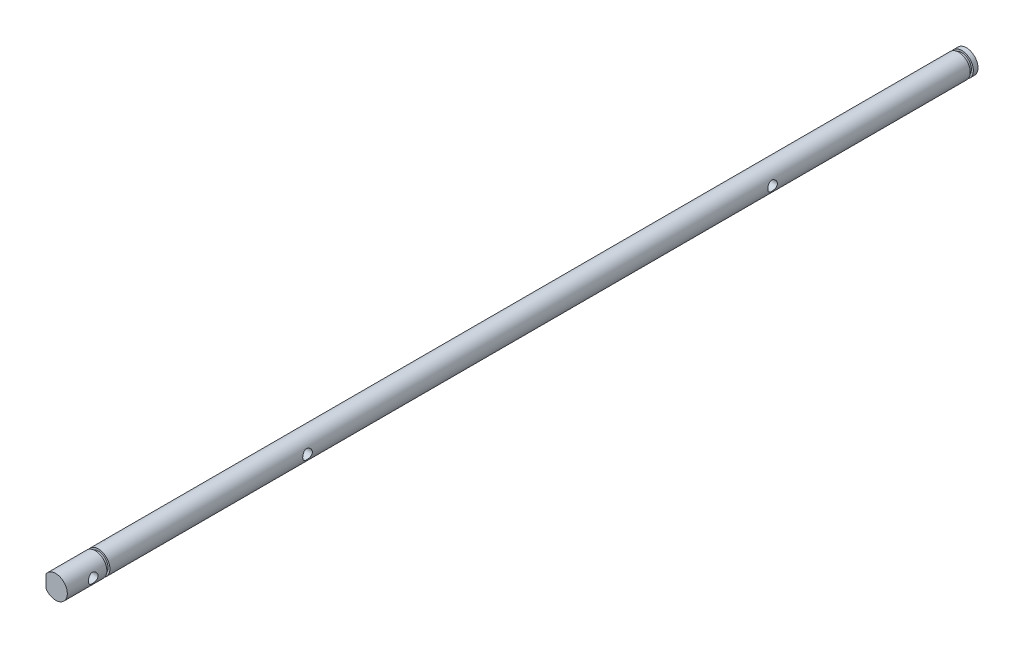
ISO-10303-21;
HEADER;
FILE_DESCRIPTION(('STEP AP214'),'2;1');
FILE_NAME('part.step','',(''),(''),'','','');
FILE_SCHEMA(('AUTOMOTIVE_DESIGN { 1 0 10303 214 1 1 1 1 }'));
ENDSEC;
DATA;
#1=APPLICATION_CONTEXT('core data for automotive mechanical design processes');
#2=APPLICATION_PROTOCOL_DEFINITION('international standard','automotive_design',2000,#1);
#3=PRODUCT_CONTEXT('',#1,'mechanical');
#4=PRODUCT('Part','Part','',(#3));
#5=PRODUCT_RELATED_PRODUCT_CATEGORY('part','',(#4));
#6=PRODUCT_DEFINITION_FORMATION('','',#4);
#7=PRODUCT_DEFINITION_CONTEXT('part definition',#1,'design');
#8=PRODUCT_DEFINITION('design','',#6,#7);
#9=PRODUCT_DEFINITION_SHAPE('','',#8);
#10=(LENGTH_UNIT() NAMED_UNIT(*) SI_UNIT(.MILLI.,.METRE.));
#11=(NAMED_UNIT(*) PLANE_ANGLE_UNIT() SI_UNIT($,.RADIAN.));
#12=(NAMED_UNIT(*) SI_UNIT($,.STERADIAN.) SOLID_ANGLE_UNIT());
#13=UNCERTAINTY_MEASURE_WITH_UNIT(LENGTH_MEASURE(1.E-05),#10,'distance_accuracy_value','');
#14=(GEOMETRIC_REPRESENTATION_CONTEXT(3) GLOBAL_UNCERTAINTY_ASSIGNED_CONTEXT((#13)) GLOBAL_UNIT_ASSIGNED_CONTEXT((#10,
#11,#12)) REPRESENTATION_CONTEXT('',''));
#15=CARTESIAN_POINT('',(0.,0.,0.));
#16=DIRECTION('',(0.,0.,1.));
#17=DIRECTION('',(1.,0.,0.));
#18=AXIS2_PLACEMENT_3D('',#15,#16,#17);
#19=CARTESIAN_POINT('',(0.,0.,235.));
#20=DIRECTION('',(0.,0.,-1.));
#21=DIRECTION('',(-1.,0.,0.));
#22=AXIS2_PLACEMENT_3D('',#19,#20,#21);
#23=CYLINDRICAL_SURFACE('',#22,3.);
#24=CARTESIAN_POINT('',(3.,0.,174.25));
#25=CARTESIAN_POINT('',(2.99999458367273,0.0669580526362664,174.249992794909));
#26=CARTESIAN_POINT('',(2.9977323297471,0.134021397063841,174.244588041472));
#27=CARTESIAN_POINT('',(2.98890153579552,0.266247371156346,174.22316093508));
#28=CARTESIAN_POINT('',(2.98232175901028,0.331404576423563,174.207110875536));
#29=CARTESIAN_POINT('',(2.96556289038127,0.457688733653088,174.165088908219));
#30=CARTESIAN_POINT('',(2.95539599975004,0.518828524426272,174.139150610532));
#31=CARTESIAN_POINT('',(2.93245286470664,0.635829756679803,174.078227176767));
#32=CARTESIAN_POINT('',(2.91967741092849,0.691692790015935,174.043244781029));
#33=CARTESIAN_POINT('',(2.89207828351869,0.799448403559509,173.963371017409));
#34=CARTESIAN_POINT('',(2.87718753326093,0.851041267517772,173.91809869121));
#35=CARTESIAN_POINT('',(2.84732714068513,0.946159821091267,173.819735665217));
#36=CARTESIAN_POINT('',(2.83235746106809,0.989681263153086,173.766640875105));
#37=CARTESIAN_POINT('',(2.80321021812995,1.06953737697065,173.650973222435));
#38=CARTESIAN_POINT('',(2.78910786873385,1.10541308153925,173.588062551573));
#39=CARTESIAN_POINT('',(2.76435572357005,1.16593940588866,173.456426742079));
#40=CARTESIAN_POINT('',(2.75370415000824,1.19059580836291,173.387704620516));
#41=CARTESIAN_POINT('',(2.73778555387705,1.22674598312159,173.249846308232));
#42=CARTESIAN_POINT('',(2.73228387651787,1.23881657877606,173.180889516608));
#43=CARTESIAN_POINT('',(2.72661326219504,1.25125209967796,173.041726707313));
#44=CARTESIAN_POINT('',(2.7264413842526,1.25162348054397,172.971521399974));
#45=CARTESIAN_POINT('',(2.73125119560853,1.24108450363674,172.837599939565));
#46=CARTESIAN_POINT('',(2.73583882723623,1.231036811123,172.773798903436));
#47=CARTESIAN_POINT('',(2.74898482773796,1.20139191015777,172.648887909));
#48=CARTESIAN_POINT('',(2.75754395703564,1.18179287287177,172.587778468508));
#49=CARTESIAN_POINT('',(2.77786184772757,1.13321958727571,172.468442297009));
#50=CARTESIAN_POINT('',(2.78968481949137,1.10405471539235,172.410304579087));
#51=CARTESIAN_POINT('',(2.81518331141086,1.03731242580561,172.29952226612));
#52=CARTESIAN_POINT('',(2.8288595612978,0.999731690519532,172.246879849386));
#53=CARTESIAN_POINT('',(2.8579297687798,0.913495965543826,172.143900041267));
#54=CARTESIAN_POINT('',(2.87337121404473,0.864173483207516,172.094133432615));
#55=CARTESIAN_POINT('',(2.9032567311253,0.757729591051503,172.003386497041));
#56=CARTESIAN_POINT('',(2.9177005687701,0.700606359448449,171.962408228308));
#57=CARTESIAN_POINT('',(2.94438283556473,0.578447948693366,171.889564176384));
#58=CARTESIAN_POINT('',(2.95656266543334,0.513260582447666,171.857930554849));
#59=CARTESIAN_POINT('',(2.97689481414803,0.377852402526821,171.806278860397));
#60=CARTESIAN_POINT('',(2.985049358458,0.307634394795034,171.786254368056));
#61=CARTESIAN_POINT('',(2.99599641186385,0.168928113346234,171.759584007873));
#62=CARTESIAN_POINT('',(2.99909541047125,0.100611285278643,171.752172142556));
#63=CARTESIAN_POINT('',(3.00056050368745,-0.0363546554960903,171.748653776386));
#64=CARTESIAN_POINT('',(2.99892795711939,-0.10500366715264,171.752544029748));
#65=CARTESIAN_POINT('',(2.9913121765694,-0.23709824234144,171.770971084806));
#66=CARTESIAN_POINT('',(2.9855488728399,-0.30063296663939,171.784969954097));
#67=CARTESIAN_POINT('',(2.97048606772414,-0.424382748971094,171.822468194541));
#68=CARTESIAN_POINT('',(2.96118611959704,-0.484597386518366,171.84596876595));
#69=CARTESIAN_POINT('',(2.93958270645166,-0.602108999869142,171.902570975712));
#70=CARTESIAN_POINT('',(2.92719491469281,-0.659257236855328,171.935948183146));
#71=CARTESIAN_POINT('',(2.9007380457909,-0.767346216231434,172.011053377792));
#72=CARTESIAN_POINT('',(2.88666826768733,-0.818284352601949,172.052784851529));
#73=CARTESIAN_POINT('',(2.85712087895437,-0.916333430274274,172.146903233272));
#74=CARTESIAN_POINT('',(2.84161451591029,-0.962910697979843,172.199838502986));
#75=CARTESIAN_POINT('',(2.81184336768005,-1.04666984610551,172.313021275935));
#76=CARTESIAN_POINT('',(2.79757886493438,-1.08384959285618,172.373270435172));
#77=CARTESIAN_POINT('',(2.77181386243988,-1.14815960208699,172.500614175303));
#78=CARTESIAN_POINT('',(2.76035562555112,-1.17513918237329,172.567794035515));
#79=CARTESIAN_POINT('',(2.74208355658957,-1.21717413951573,172.70637059381));
#80=CARTESIAN_POINT('',(2.73526589555752,-1.23223934863687,172.777763762483));
#81=CARTESIAN_POINT('',(2.72763164537264,-1.24904080348901,172.916818699199));
#82=CARTESIAN_POINT('',(2.72639350967163,-1.25171380413129,172.984344662293));
#83=CARTESIAN_POINT('',(2.72893853011024,-1.24615575523913,173.118842861141));
#84=CARTESIAN_POINT('',(2.73272091540306,-1.23792637964722,173.185815180314));
#85=CARTESIAN_POINT('',(2.74449551302268,-1.21158404780492,173.314092747469));
#86=CARTESIAN_POINT('',(2.7522835484648,-1.19394903571467,173.375516673463));
#87=CARTESIAN_POINT('',(2.77103181199189,-1.14976328202135,173.494548021357));
#88=CARTESIAN_POINT('',(2.78199293131693,-1.12321003517252,173.552154365399));
#89=CARTESIAN_POINT('',(2.80666954560013,-1.0601028593549,173.665695895949));
#90=CARTESIAN_POINT('',(2.82051102713679,-1.02304360910484,173.721322330168));
#91=CARTESIAN_POINT('',(2.84903689053839,-0.940684072630404,173.825860139361));
#92=CARTESIAN_POINT('',(2.86372156345874,-0.895380928905633,173.874769175601));
#93=CARTESIAN_POINT('',(2.89356392850106,-0.79390204577884,173.968148681685));
#94=CARTESIAN_POINT('',(2.90867817511791,-0.73717473994905,174.012036432841));
#95=CARTESIAN_POINT('',(2.9366014362202,-0.616600079253213,174.089699453544));
#96=CARTESIAN_POINT('',(2.9494093991674,-0.552749497945748,174.12347011489));
#97=CARTESIAN_POINT('',(2.97109183362461,-0.420732056717941,174.17920984544));
#98=CARTESIAN_POINT('',(2.98002782581964,-0.352653990980629,174.201364766617));
#99=CARTESIAN_POINT('',(2.99321009768625,-0.213410421846556,174.233706329078));
#100=CARTESIAN_POINT('',(2.99747105811967,-0.142255316980957,174.24393044253));
#101=CARTESIAN_POINT('',(2.99972287568934,-0.0472360819191842,174.249333161086));
#102=CARTESIAN_POINT('',(3.00000191102536,-0.0236245946756581,174.250002542149));
#103=CARTESIAN_POINT('',(3.,0.,174.25));
#104=B_SPLINE_CURVE_WITH_KNOTS('',3,(#24,#25,#26,#27,#28,#29,#30,#31,#32,#33,#34,#35,#36,#37,
#38,#39,#40,#41,#42,#43,#44,#45,#46,#47,#48,#49,#50,#51,#52,#53,#54,#55,#56,#57,#58,#59,#60,#61,
#62,#63,#64,#65,#66,#67,#68,#69,#70,#71,#72,#73,#74,#75,#76,#77,#78,#79,#80,#81,#82,#83,#84,#85,
#86,#87,#88,#89,#90,#91,#92,#93,#94,#95,#96,#97,#98,#99,#100,#101,#102,#103),.UNSPECIFIED.,.T.,
.F.,(4,2,2,2,2,2,2,2,2,2,2,2,2,2,2,2,2,2,2,2,2,2,2,2,2,2,2,2,2,2,2,2,2,2,2,2,2,2,2,4),(0.,
0.20080691888394,0.402138540628698,0.602791851906309,0.803384436852969,1.01317936288807,
1.22308438131465,1.44331724539126,1.66343646730588,1.87295273137561,2.08235338249048,
2.27570157202556,2.46908679727211,2.66658713058717,2.86416545717208,3.07844141127897,
3.29276749314589,3.51204055060815,3.73119224218296,3.93648443393251,4.14171767493172,
4.33676589735722,4.53183876601785,4.73297135272162,4.93418805469497,5.14978488029296,
5.36543061240343,5.58414788359521,5.80268447074579,6.00439877559641,6.20608211297534,
6.39837649964764,6.59072494950611,6.79463893397441,6.9986237342594,7.21746535004887,
7.43640649428583,7.65172855819385,7.86637250469321,7.93722256499098),.UNSPECIFIED.);
#105=CARTESIAN_POINT('',(3.,0.,174.25));
#106=VERTEX_POINT('',#105);
#107=EDGE_CURVE('E48',#106,#106,#104,.T.);
#108=ORIENTED_EDGE('',*,*,#107,.T.);
#109=EDGE_LOOP('',(#108));
#110=FACE_BOUND('',#109,.T.);
#111=CARTESIAN_POINT('',(3.,0.,54.25));
#112=CARTESIAN_POINT('',(2.99999458367273,0.0669580526362653,54.2499927949087));
#113=CARTESIAN_POINT('',(2.9977323297471,0.134021397063839,54.2445880414719));
#114=CARTESIAN_POINT('',(2.98890153579552,0.266247371156344,54.2231609350798));
#115=CARTESIAN_POINT('',(2.98232175901028,0.331404576423561,54.2071108755357));
#116=CARTESIAN_POINT('',(2.96556289038127,0.457688733653084,54.1650889082194));
#117=CARTESIAN_POINT('',(2.95539599975004,0.518828524426264,54.1391506105318));
#118=CARTESIAN_POINT('',(2.93245286470664,0.635829756679798,54.0782271767674));
#119=CARTESIAN_POINT('',(2.91967741092849,0.691692790015935,54.0432447810291));
#120=CARTESIAN_POINT('',(2.89207828351869,0.799448403559509,53.9633710174091));
#121=CARTESIAN_POINT('',(2.87718753326093,0.851041267517767,53.9180986912102));
#122=CARTESIAN_POINT('',(2.84732714068514,0.946159821091259,53.8197356652174));
#123=CARTESIAN_POINT('',(2.83235746106809,0.989681263153081,53.7666408751055));
#124=CARTESIAN_POINT('',(2.80321021812995,1.06953737697065,53.6509732224351));
#125=CARTESIAN_POINT('',(2.78910786873385,1.10541308153925,53.5880625515734));
#126=CARTESIAN_POINT('',(2.76435572357005,1.16593940588865,53.4564267420791));
#127=CARTESIAN_POINT('',(2.75370415000824,1.1905958083629,53.3877046205155));
#128=CARTESIAN_POINT('',(2.73778555387705,1.22674598312159,53.2498463082321));
#129=CARTESIAN_POINT('',(2.73228387651787,1.23881657877605,53.1808895166078));
#130=CARTESIAN_POINT('',(2.72661326219504,1.25125209967796,53.0417267073134));
#131=CARTESIAN_POINT('',(2.7264413842526,1.25162348054397,52.9715213999743));
#132=CARTESIAN_POINT('',(2.73125119560853,1.24108450363674,52.8375999395651));
#133=CARTESIAN_POINT('',(2.73583882723623,1.23103681112301,52.7737989034355));
#134=CARTESIAN_POINT('',(2.74898482773797,1.20139191015776,52.6488879089996));
#135=CARTESIAN_POINT('',(2.75754395703564,1.18179287287177,52.5877784685082));
#136=CARTESIAN_POINT('',(2.77786184772757,1.13321958727571,52.4684422970085));
#137=CARTESIAN_POINT('',(2.78968481949136,1.10405471539236,52.4103045790866));
#138=CARTESIAN_POINT('',(2.81518331141086,1.03731242580562,52.2995222661198));
#139=CARTESIAN_POINT('',(2.8288595612978,0.999731690519539,52.2468798493865));
#140=CARTESIAN_POINT('',(2.85792976877979,0.91349596554383,52.1439000412672));
#141=CARTESIAN_POINT('',(2.87337121404473,0.864173483207521,52.0941334326146));
#142=CARTESIAN_POINT('',(2.90325673112529,0.75772959105151,52.0033864970408));
#143=CARTESIAN_POINT('',(2.9177005687701,0.700606359448457,51.9624082283078));
#144=CARTESIAN_POINT('',(2.94438283556473,0.57844794869338,51.8895641763837));
#145=CARTESIAN_POINT('',(2.95656266543334,0.513260582447683,51.8579305548493));
#146=CARTESIAN_POINT('',(2.97689481414803,0.377852402526835,51.8062788603967));
#147=CARTESIAN_POINT('',(2.985049358458,0.307634394795039,51.7862543680562));
#148=CARTESIAN_POINT('',(2.99599641186385,0.168928113346232,51.7595840078734));
#149=CARTESIAN_POINT('',(2.99909541047125,0.100611285278643,51.7521721425562));
#150=CARTESIAN_POINT('',(3.00056050368745,-0.0363546554960863,51.7486537763859));
#151=CARTESIAN_POINT('',(2.99892795711939,-0.105003667152633,51.752544029748));
#152=CARTESIAN_POINT('',(2.9913121765694,-0.237098242341434,51.7709710848061));
#153=CARTESIAN_POINT('',(2.9855488728399,-0.300632966639385,51.7849699540972));
#154=CARTESIAN_POINT('',(2.97048606772414,-0.424382748971091,51.8224681945408));
#155=CARTESIAN_POINT('',(2.96118611959704,-0.484597386518363,51.8459687659503));
#156=CARTESIAN_POINT('',(2.93958270645166,-0.602108999869139,51.9025709757121));
#157=CARTESIAN_POINT('',(2.92719491469281,-0.659257236855326,51.935948183146));
#158=CARTESIAN_POINT('',(2.9007380457909,-0.767346216231432,52.0110533777917));
#159=CARTESIAN_POINT('',(2.88666826768733,-0.818284352601945,52.0527848515293));
#160=CARTESIAN_POINT('',(2.85712087895437,-0.916333430274267,52.1469032332724));
#161=CARTESIAN_POINT('',(2.84161451591029,-0.962910697979836,52.1998385029863));
#162=CARTESIAN_POINT('',(2.81184336768005,-1.04666984610551,52.3130212759354));
#163=CARTESIAN_POINT('',(2.79757886493438,-1.08384959285618,52.3732704351717));
#164=CARTESIAN_POINT('',(2.77181386243988,-1.14815960208699,52.5006141753026));
#165=CARTESIAN_POINT('',(2.76035562555111,-1.17513918237329,52.5677940355148));
#166=CARTESIAN_POINT('',(2.74208355658957,-1.21717413951573,52.7063705938101));
#167=CARTESIAN_POINT('',(2.73526589555752,-1.23223934863688,52.7777637624833));
#168=CARTESIAN_POINT('',(2.72763164537264,-1.24904080348901,52.9168186991992));
#169=CARTESIAN_POINT('',(2.72639350967163,-1.25171380413129,52.9843446622926));
#170=CARTESIAN_POINT('',(2.72893853011024,-1.24615575523912,53.1188428611411));
#171=CARTESIAN_POINT('',(2.73272091540306,-1.23792637964722,53.1858151803137));
#172=CARTESIAN_POINT('',(2.74449551302268,-1.21158404780491,53.3140927474689));
#173=CARTESIAN_POINT('',(2.7522835484648,-1.19394903571466,53.3755166734634));
#174=CARTESIAN_POINT('',(2.77103181199189,-1.14976328202135,53.4945480213572));
#175=CARTESIAN_POINT('',(2.78199293131693,-1.12321003517252,53.5521543653988));
#176=CARTESIAN_POINT('',(2.80666954560013,-1.0601028593549,53.6656958959491));
#177=CARTESIAN_POINT('',(2.82051102713679,-1.02304360910483,53.7213223301683));
#178=CARTESIAN_POINT('',(2.84903689053839,-0.940684072630391,53.8258601393607));
#179=CARTESIAN_POINT('',(2.86372156345875,-0.895380928905619,53.8747691756006));
#180=CARTESIAN_POINT('',(2.89356392850106,-0.79390204577882,53.9681486816847));
#181=CARTESIAN_POINT('',(2.90867817511792,-0.737174739949026,54.0120364328406));
#182=CARTESIAN_POINT('',(2.9366014362202,-0.616600079253198,54.0896994535436));
#183=CARTESIAN_POINT('',(2.9494093991674,-0.552749497945746,54.1234701148895));
#184=CARTESIAN_POINT('',(2.97109183362461,-0.420732056717952,54.1792098454399));
#185=CARTESIAN_POINT('',(2.98002782581964,-0.352653990980637,54.2013647666173));
#186=CARTESIAN_POINT('',(2.99321009768625,-0.213410421846559,54.2337063290778));
#187=CARTESIAN_POINT('',(2.99747105811967,-0.142255316980957,54.2439304425299));
#188=CARTESIAN_POINT('',(2.99972287568934,-0.0472360819191827,54.2493331610864));
#189=CARTESIAN_POINT('',(3.00000191102536,-0.0236245946756574,54.2500025421492));
#190=CARTESIAN_POINT('',(3.,0.,54.25));
#191=B_SPLINE_CURVE_WITH_KNOTS('',3,(#111,#112,#113,#114,#115,#116,#117,#118,#119,#120,#121,
#122,#123,#124,#125,#126,#127,#128,#129,#130,#131,#132,#133,#134,#135,#136,#137,#138,#139,#140,
#141,#142,#143,#144,#145,#146,#147,#148,#149,#150,#151,#152,#153,#154,#155,#156,#157,#158,#159,
#160,#161,#162,#163,#164,#165,#166,#167,#168,#169,#170,#171,#172,#173,#174,#175,#176,#177,#178,
#179,#180,#181,#182,#183,#184,#185,#186,#187,#188,#189,#190),.UNSPECIFIED.,.T.,.F.,(4,2,2,2,2,2,
2,2,2,2,2,2,2,2,2,2,2,2,2,2,2,2,2,2,2,2,2,2,2,2,2,2,2,2,2,2,2,2,2,4),(0.,0.200806918883938,
0.402138540628695,0.602791851906295,0.80338443685297,1.01317936288807,1.22308438131465,
1.44331724539125,1.66343646730588,1.87295273137557,2.08235338249046,2.27570157202557,
2.46908679727213,2.66658713058715,2.86416545717207,3.07844141127897,3.29276749314588,
3.51204055060813,3.73119224218296,3.9364844339325,4.14171767493171,4.33676589735721,
4.53183876601785,4.73297135272161,4.93418805469496,5.14978488029294,5.36543061240341,
5.58414788359523,5.80268447074581,6.00439877559644,6.20608211297536,6.39837649964762,
6.59072494950612,6.79463893397441,6.99862373425944,7.21746535004889,7.43640649428582,
7.65172855819385,7.86637250469321,7.93722256499098),.UNSPECIFIED.);
#192=CARTESIAN_POINT('',(3.,0.,54.25));
#193=VERTEX_POINT('',#192);
#194=EDGE_CURVE('E170',#193,#193,#191,.T.);
#195=ORIENTED_EDGE('',*,*,#194,.T.);
#196=EDGE_LOOP('',(#195));
#197=FACE_BOUND('',#196,.T.);
#198=DIRECTION('',(0.,0.,-1.));
#199=VECTOR('',#198,1.);
#200=CARTESIAN_POINT('',(-2.49999999999997,1.65831239517774,235.));
#201=LINE('',#200,#199);
#202=CARTESIAN_POINT('',(-2.49999999999998,1.65831239517774,178.));
#203=VERTEX_POINT('',#202);
#204=CARTESIAN_POINT('',(-2.49999999999999,1.65831239517772,168.));
#205=VERTEX_POINT('',#204);
#206=EDGE_CURVE('E158',#203,#205,#201,.T.);
#207=ORIENTED_EDGE('',*,*,#206,.F.);
#208=CARTESIAN_POINT('',(0.,0.,178.));
#209=DIRECTION('',(0.,0.,-1.));
#210=DIRECTION('',(-1.,0.,0.));
#211=AXIS2_PLACEMENT_3D('',#208,#209,#210);
#212=CIRCLE('',#211,3.);
#213=CARTESIAN_POINT('',(-2.49999999999998,-1.65831239517774,178.));
#214=VERTEX_POINT('',#213);
#215=EDGE_CURVE('E161',#214,#203,#212,.T.);
#216=ORIENTED_EDGE('',*,*,#215,.F.);
#217=DIRECTION('',(0.,0.,-1.));
#218=VECTOR('',#217,1.);
#219=CARTESIAN_POINT('',(-2.49999999999997,-1.65831239517774,235.));
#220=LINE('',#219,#218);
#221=CARTESIAN_POINT('',(-2.49999999999999,-1.65831239517772,168.));
#222=VERTEX_POINT('',#221);
#223=EDGE_CURVE('E156',#222,#214,#220,.F.);
#224=ORIENTED_EDGE('',*,*,#223,.F.);
#225=CARTESIAN_POINT('',(0.,0.,168.));
#226=DIRECTION('',(0.,0.,1.));
#227=DIRECTION('',(1.,0.,0.));
#228=AXIS2_PLACEMENT_3D('',#225,#226,#227);
#229=CIRCLE('',#228,3.);
#230=EDGE_CURVE('E111',#205,#222,#229,.T.);
#231=ORIENTED_EDGE('',*,*,#230,.F.);
#232=EDGE_LOOP('',(#207,#216,#224,#231));
#233=FACE_BOUND('',#232,.T.);
#234=CARTESIAN_POINT('',(0.,0.,224.));
#235=DIRECTION('',(0.,0.,1.));
#236=DIRECTION('',(1.,0.,0.));
#237=AXIS2_PLACEMENT_3D('',#234,#235,#236);
#238=CIRCLE('',#237,3.);
#239=CARTESIAN_POINT('',(3.,0.,224.));
#240=VERTEX_POINT('',#239);
#241=EDGE_CURVE('E139',#240,#240,#238,.T.);
#242=ORIENTED_EDGE('',*,*,#241,.F.);
#243=EDGE_LOOP('',(#242));
#244=FACE_BOUND('',#243,.T.);
#245=CARTESIAN_POINT('',(0.,0.,2.));
#246=DIRECTION('',(0.,0.,1.));
#247=DIRECTION('',(1.,0.,0.));
#248=AXIS2_PLACEMENT_3D('',#245,#246,#247);
#249=CIRCLE('',#248,3.);
#250=CARTESIAN_POINT('',(3.,0.,2.));
#251=VERTEX_POINT('',#250);
#252=EDGE_CURVE('E135',#251,#251,#249,.T.);
#253=ORIENTED_EDGE('',*,*,#252,.T.);
#254=EDGE_LOOP('',(#253));
#255=FACE_BOUND('',#254,.T.);
#256=DIRECTION('',(0.,0.,-1.));
#257=VECTOR('',#256,1.);
#258=CARTESIAN_POINT('',(-2.49999999999998,1.65831239517774,235.));
#259=LINE('',#258,#257);
#260=CARTESIAN_POINT('',(-2.5,1.65831239517774,58.));
#261=VERTEX_POINT('',#260);
#262=CARTESIAN_POINT('',(-2.5,1.6583123951777,48.));
#263=VERTEX_POINT('',#262);
#264=EDGE_CURVE('E166',#261,#263,#259,.T.);
#265=ORIENTED_EDGE('',*,*,#264,.F.);
#266=CARTESIAN_POINT('',(0.,0.,58.));
#267=DIRECTION('',(0.,0.,-1.));
#268=DIRECTION('',(-1.,0.,0.));
#269=AXIS2_PLACEMENT_3D('',#266,#267,#268);
#270=CIRCLE('',#269,3.);
#271=CARTESIAN_POINT('',(-2.5,-1.65831239517774,58.));
#272=VERTEX_POINT('',#271);
#273=EDGE_CURVE('E61',#272,#261,#270,.T.);
#274=ORIENTED_EDGE('',*,*,#273,.F.);
#275=DIRECTION('',(0.,0.,-1.));
#276=VECTOR('',#275,1.);
#277=CARTESIAN_POINT('',(-2.49999999999998,-1.65831239517774,235.));
#278=LINE('',#277,#276);
#279=CARTESIAN_POINT('',(-2.5,-1.6583123951777,48.));
#280=VERTEX_POINT('',#279);
#281=EDGE_CURVE('E55',#280,#272,#278,.F.);
#282=ORIENTED_EDGE('',*,*,#281,.F.);
#283=CARTESIAN_POINT('',(0.,0.,48.));
#284=DIRECTION('',(0.,0.,1.));
#285=DIRECTION('',(1.,0.,0.));
#286=AXIS2_PLACEMENT_3D('',#283,#284,#285);
#287=CIRCLE('',#286,3.);
#288=EDGE_CURVE('E163',#263,#280,#287,.T.);
#289=ORIENTED_EDGE('',*,*,#288,.F.);
#290=EDGE_LOOP('',(#265,#274,#282,#289));
#291=FACE_BOUND('',#290,.T.);
#292=ADVANCED_FACE('F36',(#110,#197,#233,#244,#255,#291),#23,.T.);
#293=CARTESIAN_POINT('',(0.,0.,235.));
#294=DIRECTION('',(0.,0.,1.));
#295=DIRECTION('',(1.,0.,0.));
#296=AXIS2_PLACEMENT_3D('',#293,#294,#295);
#297=PLANE('',#296);
#298=CARTESIAN_POINT('',(0.,0.,235.));
#299=DIRECTION('',(0.,0.,1.));
#300=DIRECTION('',(1.,0.,0.));
#301=AXIS2_PLACEMENT_3D('',#298,#299,#300);
#302=CIRCLE('',#301,3.);
#303=CARTESIAN_POINT('',(-2.49999999999998,-1.65831239517773,235.));
#304=VERTEX_POINT('',#303);
#305=CARTESIAN_POINT('',(-2.49999999999998,1.65831239517773,235.));
#306=VERTEX_POINT('',#305);
#307=EDGE_CURVE('E104',#304,#306,#302,.T.);
#308=ORIENTED_EDGE('',*,*,#307,.T.);
#309=DIRECTION('',(0.,-1.,0.));
#310=VECTOR('',#309,1.);
#311=CARTESIAN_POINT('',(-2.49999999999998,10.,235.));
#312=LINE('',#311,#310);
#313=EDGE_CURVE('E110',#306,#304,#312,.T.);
#314=ORIENTED_EDGE('',*,*,#313,.T.);
#315=EDGE_LOOP('',(#308,#314));
#316=FACE_BOUND('',#315,.T.);
#317=ADVANCED_FACE('F240',(#316),#297,.T.);
#318=CARTESIAN_POINT('',(3.,0.,229.55));
#319=CARTESIAN_POINT('',(2.99999458367273,0.0669580526362677,229.549992794909));
#320=CARTESIAN_POINT('',(2.9977323297471,0.134021397063842,229.544588041472));
#321=CARTESIAN_POINT('',(2.98890153579552,0.266247371156348,229.52316093508));
#322=CARTESIAN_POINT('',(2.98232175901028,0.331404576423564,229.507110875536));
#323=CARTESIAN_POINT('',(2.96556289038127,0.457688733653094,229.465088908219));
#324=CARTESIAN_POINT('',(2.95539599975003,0.518828524426282,229.439150610532));
#325=CARTESIAN_POINT('',(2.93245286470664,0.635829756679813,229.378227176767));
#326=CARTESIAN_POINT('',(2.91967741092849,0.69169279001594,229.343244781029));
#327=CARTESIAN_POINT('',(2.89207828351869,0.79944840355951,229.263371017409));
#328=CARTESIAN_POINT('',(2.87718753326093,0.851041267517774,229.21809869121));
#329=CARTESIAN_POINT('',(2.84732714068513,0.946159821091269,229.119735665217));
#330=CARTESIAN_POINT('',(2.83235746106809,0.989681263153088,229.066640875105));
#331=CARTESIAN_POINT('',(2.80321021812995,1.06953737697066,228.950973222435));
#332=CARTESIAN_POINT('',(2.78910786873385,1.10541308153925,228.888062551573));
#333=CARTESIAN_POINT('',(2.76435572357005,1.16593940588866,228.756426742079));
#334=CARTESIAN_POINT('',(2.75370415000824,1.19059580836291,228.687704620516));
#335=CARTESIAN_POINT('',(2.73778555387705,1.22674598312159,228.549846308232));
#336=CARTESIAN_POINT('',(2.73228387651787,1.23881657877605,228.480889516608));
#337=CARTESIAN_POINT('',(2.72661326219504,1.25125209967796,228.341726707313));
#338=CARTESIAN_POINT('',(2.7264413842526,1.25162348054397,228.271521399974));
#339=CARTESIAN_POINT('',(2.73125119560853,1.24108450363674,228.137599939565));
#340=CARTESIAN_POINT('',(2.73583882723623,1.23103681112301,228.073798903436));
#341=CARTESIAN_POINT('',(2.74898482773796,1.20139191015777,227.948887909));
#342=CARTESIAN_POINT('',(2.75754395703564,1.18179287287177,227.887778468508));
#343=CARTESIAN_POINT('',(2.77786184772757,1.13321958727571,227.768442297009));
#344=CARTESIAN_POINT('',(2.78968481949137,1.10405471539235,227.710304579087));
#345=CARTESIAN_POINT('',(2.81518331141086,1.03731242580561,227.59952226612));
#346=CARTESIAN_POINT('',(2.8288595612978,0.999731690519532,227.546879849386));
#347=CARTESIAN_POINT('',(2.8579297687798,0.913495965543826,227.443900041267));
#348=CARTESIAN_POINT('',(2.87337121404473,0.864173483207516,227.394133432615));
#349=CARTESIAN_POINT('',(2.9032567311253,0.757729591051503,227.303386497041));
#350=CARTESIAN_POINT('',(2.9177005687701,0.700606359448448,227.262408228308));
#351=CARTESIAN_POINT('',(2.94438283556473,0.578447948693371,227.189564176384));
#352=CARTESIAN_POINT('',(2.95656266543334,0.513260582447677,227.157930554849));
#353=CARTESIAN_POINT('',(2.97689481414803,0.377852402526834,227.106278860397));
#354=CARTESIAN_POINT('',(2.985049358458,0.30763439479504,227.086254368056));
#355=CARTESIAN_POINT('',(2.99599641186385,0.168928113346234,227.059584007873));
#356=CARTESIAN_POINT('',(2.99909541047125,0.100611285278643,227.052172142556));
#357=CARTESIAN_POINT('',(3.00056050368745,-0.0363546554960897,227.048653776386));
#358=CARTESIAN_POINT('',(2.99892795711939,-0.105003667152639,227.052544029748));
#359=CARTESIAN_POINT('',(2.9913121765694,-0.23709824234144,227.070971084806));
#360=CARTESIAN_POINT('',(2.9855488728399,-0.30063296663939,227.084969954097));
#361=CARTESIAN_POINT('',(2.97048606772414,-0.424382748971095,227.122468194541));
#362=CARTESIAN_POINT('',(2.96118611959704,-0.484597386518367,227.14596876595));
#363=CARTESIAN_POINT('',(2.93958270645166,-0.602108999869142,227.202570975712));
#364=CARTESIAN_POINT('',(2.92719491469281,-0.659257236855327,227.235948183146));
#365=CARTESIAN_POINT('',(2.9007380457909,-0.767346216231432,227.311053377792));
#366=CARTESIAN_POINT('',(2.88666826768733,-0.818284352601947,227.352784851529));
#367=CARTESIAN_POINT('',(2.85712087895437,-0.916333430274271,227.446903233272));
#368=CARTESIAN_POINT('',(2.84161451591029,-0.962910697979841,227.499838502986));
#369=CARTESIAN_POINT('',(2.81184336768005,-1.04666984610551,227.613021275935));
#370=CARTESIAN_POINT('',(2.79757886493438,-1.08384959285618,227.673270435172));
#371=CARTESIAN_POINT('',(2.77181386243988,-1.148159602087,227.800614175303));
#372=CARTESIAN_POINT('',(2.76035562555111,-1.17513918237329,227.867794035515));
#373=CARTESIAN_POINT('',(2.74208355658957,-1.21717413951573,228.00637059381));
#374=CARTESIAN_POINT('',(2.73526589555752,-1.23223934863687,228.077763762483));
#375=CARTESIAN_POINT('',(2.72763164537264,-1.249040803489,228.216818699199));
#376=CARTESIAN_POINT('',(2.72639350967163,-1.25171380413129,228.284344662293));
#377=CARTESIAN_POINT('',(2.72893853011024,-1.24615575523912,228.418842861141));
#378=CARTESIAN_POINT('',(2.73272091540306,-1.23792637964721,228.485815180314));
#379=CARTESIAN_POINT('',(2.74449551302268,-1.21158404780491,228.614092747469));
#380=CARTESIAN_POINT('',(2.7522835484648,-1.19394903571467,228.675516673463));
#381=CARTESIAN_POINT('',(2.77103181199189,-1.14976328202135,228.794548021357));
#382=CARTESIAN_POINT('',(2.78199293131693,-1.12321003517252,228.852154365399));
#383=CARTESIAN_POINT('',(2.80666954560013,-1.0601028593549,228.965695895949));
#384=CARTESIAN_POINT('',(2.82051102713679,-1.02304360910484,229.021322330168));
#385=CARTESIAN_POINT('',(2.84903689053839,-0.940684072630403,229.125860139361));
#386=CARTESIAN_POINT('',(2.86372156345874,-0.895380928905633,229.174769175601));
#387=CARTESIAN_POINT('',(2.89356392850106,-0.79390204577884,229.268148681685));
#388=CARTESIAN_POINT('',(2.90867817511791,-0.73717473994905,229.312036432841));
#389=CARTESIAN_POINT('',(2.9366014362202,-0.616600079253213,229.389699453544));
#390=CARTESIAN_POINT('',(2.9494093991674,-0.552749497945748,229.42347011489));
#391=CARTESIAN_POINT('',(2.97109183362461,-0.420732056717943,229.47920984544));
#392=CARTESIAN_POINT('',(2.98002782581964,-0.35265399098063,229.501364766617));
#393=CARTESIAN_POINT('',(2.99321009768625,-0.213410421846558,229.533706329078));
#394=CARTESIAN_POINT('',(2.99747105811967,-0.142255316980959,229.54393044253));
#395=CARTESIAN_POINT('',(2.99972287568934,-0.0472360819191854,229.549333161086));
#396=CARTESIAN_POINT('',(3.00000191102536,-0.0236245946756581,229.550002542149));
#397=CARTESIAN_POINT('',(3.,0.,229.55));
#398=B_SPLINE_CURVE_WITH_KNOTS('',3,(#318,#319,#320,#321,#322,#323,#324,#325,#326,#327,#328,
#329,#330,#331,#332,#333,#334,#335,#336,#337,#338,#339,#340,#341,#342,#343,#344,#345,#346,#347,
#348,#349,#350,#351,#352,#353,#354,#355,#356,#357,#358,#359,#360,#361,#362,#363,#364,#365,#366,
#367,#368,#369,#370,#371,#372,#373,#374,#375,#376,#377,#378,#379,#380,#381,#382,#383,#384,#385,
#386,#387,#388,#389,#390,#391,#392,#393,#394,#395,#396,#397),.UNSPECIFIED.,.T.,.F.,(4,2,2,2,2,2,
2,2,2,2,2,2,2,2,2,2,2,2,2,2,2,2,2,2,2,2,2,2,2,2,2,2,2,2,2,2,2,2,2,4),(0.,0.20080691888394,
0.402138540628698,0.60279185190632,0.80338443685297,1.01317936288807,1.22308438131465,
1.44331724539126,1.66343646730588,1.87295273137558,2.08235338249048,2.27570157202556,
2.46908679727212,2.66658713058717,2.86416545717208,3.07844141127897,3.29276749314589,
3.51204055060813,3.73119224218296,3.93648443393251,4.14171767493173,4.33676589735722,
4.53183876601785,4.73297135272162,4.93418805469497,5.14978488029296,5.36543061240343,
5.58414788359524,5.80268447074579,6.00439877559641,6.20608211297535,6.39837649964764,
6.59072494950612,6.79463893397441,6.9986237342594,7.21746535004887,7.43640649428583,
7.65172855819385,7.86637250469321,7.93722256499098),.UNSPECIFIED.);
#399=CARTESIAN_POINT('',(3.,0.,229.55));
#400=VERTEX_POINT('',#399);
#401=EDGE_CURVE('E11',#400,#400,#398,.T.);
#402=ORIENTED_EDGE('',*,*,#401,.T.);
#403=EDGE_LOOP('',(#402));
#404=FACE_BOUND('',#403,.T.);
#405=CARTESIAN_POINT('',(0.,0.,224.8));
#406=DIRECTION('',(0.,0.,1.));
#407=DIRECTION('',(1.,0.,0.));
#408=AXIS2_PLACEMENT_3D('',#405,#406,#407);
#409=CIRCLE('',#408,3.);
#410=CARTESIAN_POINT('',(3.,0.,224.8));
#411=VERTEX_POINT('',#410);
#412=EDGE_CURVE('E129',#411,#411,#409,.T.);
#413=ORIENTED_EDGE('',*,*,#412,.T.);
#414=EDGE_LOOP('',(#413));
#415=FACE_BOUND('',#414,.T.);
#416=DIRECTION('',(0.,0.,-1.));
#417=VECTOR('',#416,1.);
#418=CARTESIAN_POINT('',(-2.49999999999998,1.65831239517773,235.));
#419=LINE('',#418,#417);
#420=CARTESIAN_POINT('',(-2.49999999999998,1.65831239517773,226.));
#421=VERTEX_POINT('',#420);
#422=EDGE_CURVE('E98',#306,#421,#419,.T.);
#423=ORIENTED_EDGE('',*,*,#422,.F.);
#424=ORIENTED_EDGE('',*,*,#307,.F.);
#425=DIRECTION('',(0.,0.,-1.));
#426=VECTOR('',#425,1.);
#427=CARTESIAN_POINT('',(-2.49999999999998,-1.65831239517773,235.));
#428=LINE('',#427,#426);
#429=CARTESIAN_POINT('',(-2.49999999999998,-1.65831239517773,226.));
#430=VERTEX_POINT('',#429);
#431=EDGE_CURVE('E100',#430,#304,#428,.F.);
#432=ORIENTED_EDGE('',*,*,#431,.F.);
#433=CARTESIAN_POINT('',(0.,0.,226.));
#434=DIRECTION('',(0.,0.,1.));
#435=DIRECTION('',(1.,0.,0.));
#436=AXIS2_PLACEMENT_3D('',#433,#434,#435);
#437=CIRCLE('',#436,3.);
#438=EDGE_CURVE('E94',#421,#430,#437,.T.);
#439=ORIENTED_EDGE('',*,*,#438,.F.);
#440=EDGE_LOOP('',(#423,#424,#432,#439));
#441=FACE_BOUND('',#440,.T.);
#442=ADVANCED_FACE('F96',(#404,#415,#441),#23,.T.);
#443=CARTESIAN_POINT('',(0.,0.,0.));
#444=DIRECTION('',(0.,0.,1.));
#445=DIRECTION('',(1.,0.,0.));
#446=AXIS2_PLACEMENT_3D('',#443,#444,#445);
#447=CIRCLE('',#446,3.);
#448=CARTESIAN_POINT('',(3.,0.,0.));
#449=VERTEX_POINT('',#448);
#450=EDGE_CURVE('E138',#449,#449,#447,.T.);
#451=ORIENTED_EDGE('',*,*,#450,.T.);
#452=EDGE_LOOP('',(#451));
#453=FACE_BOUND('',#452,.T.);
#454=CARTESIAN_POINT('',(0.,0.,1.20000000000001));
#455=DIRECTION('',(0.,0.,1.));
#456=DIRECTION('',(1.,0.,0.));
#457=AXIS2_PLACEMENT_3D('',#454,#455,#456);
#458=CIRCLE('',#457,3.);
#459=CARTESIAN_POINT('',(3.,0.,1.20000000000001));
#460=VERTEX_POINT('',#459);
#461=EDGE_CURVE('E125',#460,#460,#458,.T.);
#462=ORIENTED_EDGE('',*,*,#461,.F.);
#463=EDGE_LOOP('',(#462));
#464=FACE_BOUND('',#463,.T.);
#465=ADVANCED_FACE('F244',(#453,#464),#23,.T.);
#466=CARTESIAN_POINT('',(0.,0.,0.));
#467=DIRECTION('',(0.,0.,1.));
#468=DIRECTION('',(1.,0.,0.));
#469=AXIS2_PLACEMENT_3D('',#466,#467,#468);
#470=PLANE('',#469);
#471=ORIENTED_EDGE('',*,*,#450,.F.);
#472=EDGE_LOOP('',(#471));
#473=FACE_BOUND('',#472,.T.);
#474=ADVANCED_FACE('F228',(#473),#470,.F.);
#475=CARTESIAN_POINT('',(-3.,0.,2.));
#476=DIRECTION('',(0.,0.,-1.));
#477=DIRECTION('',(-1.,0.,0.));
#478=AXIS2_PLACEMENT_3D('',#475,#476,#477);
#479=PLANE('',#478);
#480=CARTESIAN_POINT('',(0.,0.,2.));
#481=DIRECTION('',(0.,0.,1.));
#482=DIRECTION('',(1.,0.,0.));
#483=AXIS2_PLACEMENT_3D('',#480,#481,#482);
#484=CIRCLE('',#483,2.5);
#485=CARTESIAN_POINT('',(2.5,0.,2.));
#486=VERTEX_POINT('',#485);
#487=EDGE_CURVE('E132',#486,#486,#484,.T.);
#488=ORIENTED_EDGE('',*,*,#487,.T.);
#489=EDGE_LOOP('',(#488));
#490=FACE_BOUND('',#489,.T.);
#491=ORIENTED_EDGE('',*,*,#252,.F.);
#492=EDGE_LOOP('',(#491));
#493=FACE_BOUND('',#492,.T.);
#494=ADVANCED_FACE('F224',(#490,#493),#479,.T.);
#495=CARTESIAN_POINT('',(0.,0.,240.));
#496=DIRECTION('',(0.,0.,1.));
#497=DIRECTION('',(1.,0.,0.));
#498=AXIS2_PLACEMENT_3D('',#495,#496,#497);
#499=CYLINDRICAL_SURFACE('',#498,2.5);
#500=CARTESIAN_POINT('',(0.,0.,1.20000000000001));
#501=DIRECTION('',(0.,0.,1.));
#502=DIRECTION('',(1.,0.,0.));
#503=AXIS2_PLACEMENT_3D('',#500,#501,#502);
#504=CIRCLE('',#503,2.5);
#505=CARTESIAN_POINT('',(2.5,0.,1.20000000000001));
#506=VERTEX_POINT('',#505);
#507=EDGE_CURVE('E128',#506,#506,#504,.T.);
#508=ORIENTED_EDGE('',*,*,#507,.T.);
#509=EDGE_LOOP('',(#508));
#510=FACE_BOUND('',#509,.T.);
#511=ORIENTED_EDGE('',*,*,#487,.F.);
#512=EDGE_LOOP('',(#511));
#513=FACE_BOUND('',#512,.T.);
#514=ADVANCED_FACE('F220',(#510,#513),#499,.T.);
#515=CARTESIAN_POINT('',(-3.,0.,1.2));
#516=DIRECTION('',(0.,0.,1.));
#517=DIRECTION('',(1.,0.,0.));
#518=AXIS2_PLACEMENT_3D('',#515,#516,#517);
#519=PLANE('',#518);
#520=ORIENTED_EDGE('',*,*,#461,.T.);
#521=EDGE_LOOP('',(#520));
#522=FACE_BOUND('',#521,.T.);
#523=ORIENTED_EDGE('',*,*,#507,.F.);
#524=EDGE_LOOP('',(#523));
#525=FACE_BOUND('',#524,.T.);
#526=ADVANCED_FACE('F216',(#522,#525),#519,.T.);
#527=CARTESIAN_POINT('',(-3.,0.,224.8));
#528=DIRECTION('',(0.,0.,-1.));
#529=DIRECTION('',(-1.,0.,0.));
#530=AXIS2_PLACEMENT_3D('',#527,#528,#529);
#531=PLANE('',#530);
#532=CARTESIAN_POINT('',(0.,0.,224.8));
#533=DIRECTION('',(0.,0.,1.));
#534=DIRECTION('',(1.,0.,0.));
#535=AXIS2_PLACEMENT_3D('',#532,#533,#534);
#536=CIRCLE('',#535,2.49999999999997);
#537=CARTESIAN_POINT('',(2.49999999999997,0.,224.8));
#538=VERTEX_POINT('',#537);
#539=EDGE_CURVE('E146',#538,#538,#536,.T.);
#540=ORIENTED_EDGE('',*,*,#539,.T.);
#541=EDGE_LOOP('',(#540));
#542=FACE_BOUND('',#541,.T.);
#543=ORIENTED_EDGE('',*,*,#412,.F.);
#544=EDGE_LOOP('',(#543));
#545=FACE_BOUND('',#544,.T.);
#546=ADVANCED_FACE('F219',(#542,#545),#531,.T.);
#547=CARTESIAN_POINT('',(0.,0.,240.));
#548=DIRECTION('',(0.,0.,1.));
#549=DIRECTION('',(1.,0.,0.));
#550=AXIS2_PLACEMENT_3D('',#547,#548,#549);
#551=CYLINDRICAL_SURFACE('',#550,2.49999999999997);
#552=CARTESIAN_POINT('',(0.,0.,224.));
#553=DIRECTION('',(0.,0.,1.));
#554=DIRECTION('',(1.,0.,0.));
#555=AXIS2_PLACEMENT_3D('',#552,#553,#554);
#556=CIRCLE('',#555,2.49999999999997);
#557=CARTESIAN_POINT('',(2.49999999999997,0.,224.));
#558=VERTEX_POINT('',#557);
#559=EDGE_CURVE('E142',#558,#558,#556,.T.);
#560=ORIENTED_EDGE('',*,*,#559,.T.);
#561=EDGE_LOOP('',(#560));
#562=FACE_BOUND('',#561,.T.);
#563=ORIENTED_EDGE('',*,*,#539,.F.);
#564=EDGE_LOOP('',(#563));
#565=FACE_BOUND('',#564,.T.);
#566=ADVANCED_FACE('F232',(#562,#565),#551,.T.);
#567=CARTESIAN_POINT('',(-3.,0.,224.));
#568=DIRECTION('',(0.,0.,1.));
#569=DIRECTION('',(1.,0.,0.));
#570=AXIS2_PLACEMENT_3D('',#567,#568,#569);
#571=PLANE('',#570);
#572=ORIENTED_EDGE('',*,*,#241,.T.);
#573=EDGE_LOOP('',(#572));
#574=FACE_BOUND('',#573,.T.);
#575=ORIENTED_EDGE('',*,*,#559,.F.);
#576=EDGE_LOOP('',(#575));
#577=FACE_BOUND('',#576,.T.);
#578=ADVANCED_FACE('F214',(#574,#577),#571,.T.);
#579=CARTESIAN_POINT('',(-2.49999999999998,10.,235.));
#580=DIRECTION('',(-1.,0.,0.));
#581=DIRECTION('',(0.,0.,1.));
#582=AXIS2_PLACEMENT_3D('',#579,#580,#581);
#583=PLANE('',#582);
#584=CARTESIAN_POINT('',(-2.49999999999998,0.,228.3));
#585=DIRECTION('',(-1.,0.,0.));
#586=DIRECTION('',(0.,0.,1.));
#587=AXIS2_PLACEMENT_3D('',#584,#585,#586);
#588=CIRCLE('',#587,1.25);
#589=CARTESIAN_POINT('',(-2.49999999999998,0.,229.55));
#590=VERTEX_POINT('',#589);
#591=EDGE_CURVE('E276',#590,#590,#588,.T.);
#592=ORIENTED_EDGE('',*,*,#591,.F.);
#593=EDGE_LOOP('',(#592));
#594=FACE_BOUND('',#593,.T.);
#595=ORIENTED_EDGE('',*,*,#422,.T.);
#596=DIRECTION('',(0.,-1.,0.));
#597=VECTOR('',#596,1.);
#598=CARTESIAN_POINT('',(-2.49999999999998,10.,226.));
#599=LINE('',#598,#597);
#600=EDGE_CURVE('E108',#421,#430,#599,.T.);
#601=ORIENTED_EDGE('',*,*,#600,.T.);
#602=ORIENTED_EDGE('',*,*,#431,.T.);
#603=ORIENTED_EDGE('',*,*,#313,.F.);
#604=EDGE_LOOP('',(#595,#601,#602,#603));
#605=FACE_BOUND('',#604,.T.);
#606=ADVANCED_FACE('F107',(#594,#605),#583,.T.);
#607=CARTESIAN_POINT('',(-3.,10.,226.));
#608=DIRECTION('',(0.,0.,1.));
#609=DIRECTION('',(1.,0.,0.));
#610=AXIS2_PLACEMENT_3D('',#607,#608,#609);
#611=PLANE('',#610);
#612=ORIENTED_EDGE('',*,*,#600,.F.);
#613=ORIENTED_EDGE('',*,*,#438,.T.);
#614=EDGE_LOOP('',(#612,#613));
#615=FACE_BOUND('',#614,.T.);
#616=ADVANCED_FACE('F113',(#615),#611,.T.);
#617=CARTESIAN_POINT('',(-3.,10.,178.));
#618=DIRECTION('',(0.,0.,-1.));
#619=DIRECTION('',(-1.,0.,0.));
#620=AXIS2_PLACEMENT_3D('',#617,#618,#619);
#621=PLANE('',#620);
#622=ORIENTED_EDGE('',*,*,#215,.T.);
#623=DIRECTION('',(0.,-1.,0.));
#624=VECTOR('',#623,1.);
#625=CARTESIAN_POINT('',(-2.49999999999998,10.,178.));
#626=LINE('',#625,#624);
#627=EDGE_CURVE('E122',#203,#214,#626,.T.);
#628=ORIENTED_EDGE('',*,*,#627,.T.);
#629=EDGE_LOOP('',(#622,#628));
#630=FACE_BOUND('',#629,.T.);
#631=ADVANCED_FACE('F205',(#630),#621,.T.);
#632=CARTESIAN_POINT('',(-2.49999999999999,10.,168.));
#633=DIRECTION('',(-1.,0.,0.));
#634=DIRECTION('',(0.,0.,1.));
#635=AXIS2_PLACEMENT_3D('',#632,#633,#634);
#636=PLANE('',#635);
#637=CARTESIAN_POINT('',(-2.49999999999998,0.,173.));
#638=DIRECTION('',(-1.,0.,0.));
#639=DIRECTION('',(0.,0.,1.));
#640=AXIS2_PLACEMENT_3D('',#637,#638,#639);
#641=CIRCLE('',#640,1.25);
#642=CARTESIAN_POINT('',(-2.49999999999998,0.,174.25));
#643=VERTEX_POINT('',#642);
#644=EDGE_CURVE('E119',#643,#643,#641,.T.);
#645=ORIENTED_EDGE('',*,*,#644,.F.);
#646=EDGE_LOOP('',(#645));
#647=FACE_BOUND('',#646,.T.);
#648=ORIENTED_EDGE('',*,*,#206,.T.);
#649=DIRECTION('',(0.,-1.,0.));
#650=VECTOR('',#649,1.);
#651=CARTESIAN_POINT('',(-2.49999999999999,10.,168.));
#652=LINE('',#651,#650);
#653=EDGE_CURVE('E116',#205,#222,#652,.T.);
#654=ORIENTED_EDGE('',*,*,#653,.T.);
#655=ORIENTED_EDGE('',*,*,#223,.T.);
#656=ORIENTED_EDGE('',*,*,#627,.F.);
#657=EDGE_LOOP('',(#648,#654,#655,#656));
#658=FACE_BOUND('',#657,.T.);
#659=ADVANCED_FACE('F201',(#647,#658),#636,.T.);
#660=CARTESIAN_POINT('',(-3.,10.,168.));
#661=DIRECTION('',(0.,0.,1.));
#662=DIRECTION('',(1.,0.,0.));
#663=AXIS2_PLACEMENT_3D('',#660,#661,#662);
#664=PLANE('',#663);
#665=ORIENTED_EDGE('',*,*,#653,.F.);
#666=ORIENTED_EDGE('',*,*,#230,.T.);
#667=EDGE_LOOP('',(#665,#666));
#668=FACE_BOUND('',#667,.T.);
#669=ADVANCED_FACE('F198',(#668),#664,.T.);
#670=CARTESIAN_POINT('',(-3.,10.,58.));
#671=DIRECTION('',(0.,0.,-1.));
#672=DIRECTION('',(-1.,0.,0.));
#673=AXIS2_PLACEMENT_3D('',#670,#671,#672);
#674=PLANE('',#673);
#675=ORIENTED_EDGE('',*,*,#273,.T.);
#676=DIRECTION('',(0.,-1.,0.));
#677=VECTOR('',#676,1.);
#678=CARTESIAN_POINT('',(-2.5,10.,58.));
#679=LINE('',#678,#677);
#680=EDGE_CURVE('E143',#261,#272,#679,.T.);
#681=ORIENTED_EDGE('',*,*,#680,.T.);
#682=EDGE_LOOP('',(#675,#681));
#683=FACE_BOUND('',#682,.T.);
#684=ADVANCED_FACE('F194',(#683),#674,.T.);
#685=CARTESIAN_POINT('',(-2.5,10.,48.));
#686=DIRECTION('',(-1.,0.,0.));
#687=DIRECTION('',(0.,0.,1.));
#688=AXIS2_PLACEMENT_3D('',#685,#686,#687);
#689=PLANE('',#688);
#690=CARTESIAN_POINT('',(-2.5,0.,53.));
#691=DIRECTION('',(-1.,0.,0.));
#692=DIRECTION('',(0.,0.,1.));
#693=AXIS2_PLACEMENT_3D('',#690,#691,#692);
#694=CIRCLE('',#693,1.25);
#695=CARTESIAN_POINT('',(-2.5,0.,54.25));
#696=VERTEX_POINT('',#695);
#697=EDGE_CURVE('E114',#696,#696,#694,.T.);
#698=ORIENTED_EDGE('',*,*,#697,.F.);
#699=EDGE_LOOP('',(#698));
#700=FACE_BOUND('',#699,.T.);
#701=ORIENTED_EDGE('',*,*,#264,.T.);
#702=DIRECTION('',(0.,-1.,0.));
#703=VECTOR('',#702,1.);
#704=CARTESIAN_POINT('',(-2.5,10.,48.));
#705=LINE('',#704,#703);
#706=EDGE_CURVE('E281',#263,#280,#705,.T.);
#707=ORIENTED_EDGE('',*,*,#706,.T.);
#708=ORIENTED_EDGE('',*,*,#281,.T.);
#709=ORIENTED_EDGE('',*,*,#680,.F.);
#710=EDGE_LOOP('',(#701,#707,#708,#709));
#711=FACE_BOUND('',#710,.T.);
#712=ADVANCED_FACE('F190',(#700,#711),#689,.T.);
#713=CARTESIAN_POINT('',(-3.,10.,48.));
#714=DIRECTION('',(0.,0.,1.));
#715=DIRECTION('',(1.,0.,0.));
#716=AXIS2_PLACEMENT_3D('',#713,#714,#715);
#717=PLANE('',#716);
#718=ORIENTED_EDGE('',*,*,#706,.F.);
#719=ORIENTED_EDGE('',*,*,#288,.T.);
#720=EDGE_LOOP('',(#718,#719));
#721=FACE_BOUND('',#720,.T.);
#722=ADVANCED_FACE('F185',(#721),#717,.T.);
#723=CARTESIAN_POINT('',(-2.5,0.,53.));
#724=DIRECTION('',(-1.,0.,0.));
#725=DIRECTION('',(0.,0.,1.));
#726=AXIS2_PLACEMENT_3D('',#723,#724,#725);
#727=CYLINDRICAL_SURFACE('',#726,1.25);
#728=ORIENTED_EDGE('',*,*,#697,.T.);
#729=EDGE_LOOP('',(#728));
#730=FACE_BOUND('',#729,.T.);
#731=ORIENTED_EDGE('',*,*,#194,.F.);
#732=EDGE_LOOP('',(#731));
#733=FACE_BOUND('',#732,.T.);
#734=ADVANCED_FACE('F180',(#730,#733),#727,.F.);
#735=CARTESIAN_POINT('',(-2.49999999999998,0.,173.));
#736=DIRECTION('',(-1.,0.,0.));
#737=DIRECTION('',(0.,0.,1.));
#738=AXIS2_PLACEMENT_3D('',#735,#736,#737);
#739=CYLINDRICAL_SURFACE('',#738,1.25);
#740=ORIENTED_EDGE('',*,*,#644,.T.);
#741=EDGE_LOOP('',(#740));
#742=FACE_BOUND('',#741,.T.);
#743=ORIENTED_EDGE('',*,*,#107,.F.);
#744=EDGE_LOOP('',(#743));
#745=FACE_BOUND('',#744,.T.);
#746=ADVANCED_FACE('F184',(#742,#745),#739,.F.);
#747=CARTESIAN_POINT('',(-2.49999999999998,0.,228.3));
#748=DIRECTION('',(-1.,0.,0.));
#749=DIRECTION('',(0.,0.,1.));
#750=AXIS2_PLACEMENT_3D('',#747,#748,#749);
#751=CYLINDRICAL_SURFACE('',#750,1.25);
#752=ORIENTED_EDGE('',*,*,#591,.T.);
#753=EDGE_LOOP('',(#752));
#754=FACE_BOUND('',#753,.T.);
#755=ORIENTED_EDGE('',*,*,#401,.F.);
#756=EDGE_LOOP('',(#755));
#757=FACE_BOUND('',#756,.T.);
#758=ADVANCED_FACE('F266',(#754,#757),#751,.F.);
#759=CLOSED_SHELL('',(#292,#317,#442,#465,#474,#494,#514,#526,#546,#566,#578,#606,#616,#631,
#659,#669,#684,#712,#722,#734,#746,#758));
#760=MANIFOLD_SOLID_BREP('B2',#759);
#761=ADVANCED_BREP_SHAPE_REPRESENTATION('',(#18,#760),#14);
#762=SHAPE_DEFINITION_REPRESENTATION(#9,#761);
ENDSEC;
END-ISO-10303-21;
